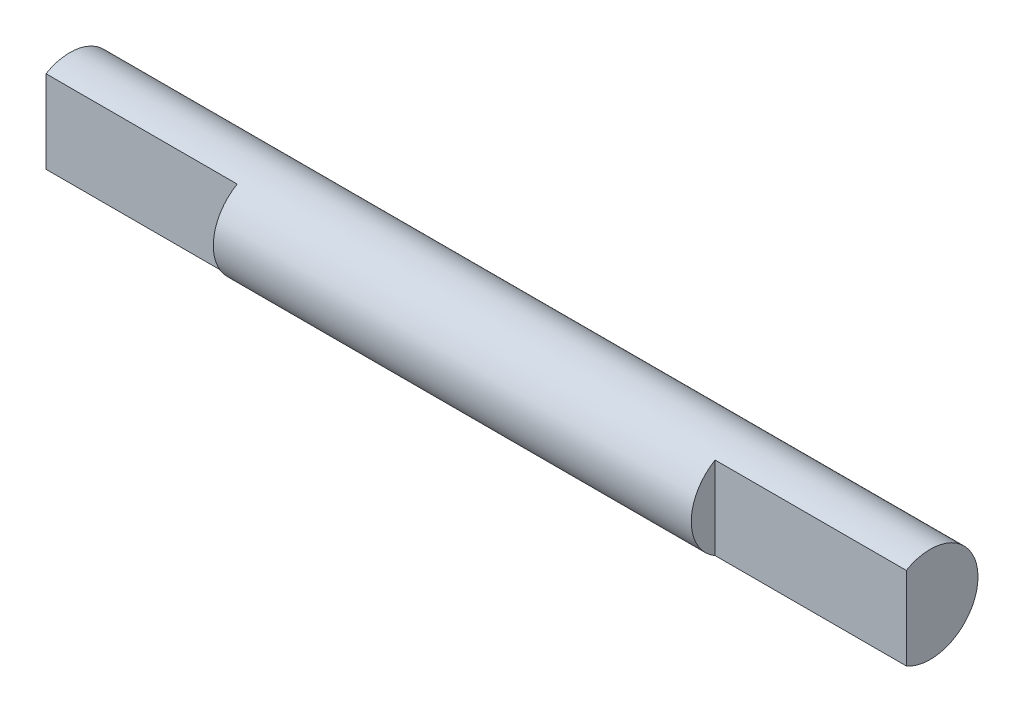
ISO-10303-21;
HEADER;
FILE_DESCRIPTION(('STEP AP214'),'2;1');
FILE_NAME('part.step','',(''),(''),'','','');
FILE_SCHEMA(('AUTOMOTIVE_DESIGN { 1 0 10303 214 1 1 1 1 }'));
ENDSEC;
DATA;
#1=APPLICATION_CONTEXT('core data for automotive mechanical design processes');
#2=APPLICATION_PROTOCOL_DEFINITION('international standard','automotive_design',2000,#1);
#3=PRODUCT_CONTEXT('',#1,'mechanical');
#4=PRODUCT('Part','Part','',(#3));
#5=PRODUCT_RELATED_PRODUCT_CATEGORY('part','',(#4));
#6=PRODUCT_DEFINITION_FORMATION('','',#4);
#7=PRODUCT_DEFINITION_CONTEXT('part definition',#1,'design');
#8=PRODUCT_DEFINITION('design','',#6,#7);
#9=PRODUCT_DEFINITION_SHAPE('','',#8);
#10=(LENGTH_UNIT() NAMED_UNIT(*) SI_UNIT(.MILLI.,.METRE.));
#11=(NAMED_UNIT(*) PLANE_ANGLE_UNIT() SI_UNIT($,.RADIAN.));
#12=(NAMED_UNIT(*) SI_UNIT($,.STERADIAN.) SOLID_ANGLE_UNIT());
#13=UNCERTAINTY_MEASURE_WITH_UNIT(LENGTH_MEASURE(1.E-05),#10,'distance_accuracy_value','');
#14=(GEOMETRIC_REPRESENTATION_CONTEXT(3) GLOBAL_UNCERTAINTY_ASSIGNED_CONTEXT((#13)) GLOBAL_UNIT_ASSIGNED_CONTEXT((#10,
#11,#12)) REPRESENTATION_CONTEXT('',''));
#15=CARTESIAN_POINT('',(0.,0.,0.));
#16=DIRECTION('',(0.,0.,1.));
#17=DIRECTION('',(1.,0.,0.));
#18=AXIS2_PLACEMENT_3D('',#15,#16,#17);
#19=CARTESIAN_POINT('',(63.5,0.,0.));
#20=DIRECTION('',(-1.,0.,0.));
#21=DIRECTION('',(0.,0.,1.));
#22=AXIS2_PLACEMENT_3D('',#19,#20,#21);
#23=CYLINDRICAL_SURFACE('',#22,12.7);
#24=CARTESIAN_POINT('',(63.5,0.,0.));
#25=DIRECTION('',(1.,0.,0.));
#26=DIRECTION('',(0.,0.,-1.));
#27=AXIS2_PLACEMENT_3D('',#24,#25,#26);
#28=CIRCLE('',#27,12.7);
#29=CARTESIAN_POINT('',(63.5,10.9985226280624,6.35));
#30=VERTEX_POINT('',#29);
#31=CARTESIAN_POINT('',(63.5,-10.9985226280624,6.35));
#32=VERTEX_POINT('',#31);
#33=EDGE_CURVE('E11',#30,#32,#28,.T.);
#34=ORIENTED_EDGE('',*,*,#33,.F.);
#35=DIRECTION('',(-1.,0.,0.));
#36=VECTOR('',#35,1.);
#37=CARTESIAN_POINT('',(114.3,10.9985226280624,6.35));
#38=LINE('',#37,#36);
#39=CARTESIAN_POINT('',(114.3,10.9985226280624,6.35));
#40=VERTEX_POINT('',#39);
#41=EDGE_CURVE('E100',#40,#30,#38,.T.);
#42=ORIENTED_EDGE('',*,*,#41,.F.);
#43=CARTESIAN_POINT('',(114.3,0.,0.));
#44=DIRECTION('',(1.,0.,0.));
#45=DIRECTION('',(0.,0.,-1.));
#46=AXIS2_PLACEMENT_3D('',#43,#44,#45);
#47=CIRCLE('',#46,12.7);
#48=CARTESIAN_POINT('',(114.3,-10.9985226280624,6.35));
#49=VERTEX_POINT('',#48);
#50=EDGE_CURVE('E91',#49,#40,#47,.T.);
#51=ORIENTED_EDGE('',*,*,#50,.F.);
#52=DIRECTION('',(-1.,0.,0.));
#53=VECTOR('',#52,1.);
#54=CARTESIAN_POINT('',(114.3,-10.9985226280624,6.35));
#55=LINE('',#54,#53);
#56=EDGE_CURVE('E96',#49,#32,#55,.T.);
#57=ORIENTED_EDGE('',*,*,#56,.T.);
#58=EDGE_LOOP('',(#34,#42,#51,#57));
#59=FACE_BOUND('',#58,.T.);
#60=CARTESIAN_POINT('',(-63.5,0.,0.));
#61=DIRECTION('',(1.,0.,0.));
#62=DIRECTION('',(0.,0.,-1.));
#63=AXIS2_PLACEMENT_3D('',#60,#61,#62);
#64=CIRCLE('',#63,12.7);
#65=CARTESIAN_POINT('',(-63.5,10.9985226280624,6.35));
#66=VERTEX_POINT('',#65);
#67=CARTESIAN_POINT('',(-63.5,-10.9985226280624,6.35));
#68=VERTEX_POINT('',#67);
#69=EDGE_CURVE('E38',#66,#68,#64,.T.);
#70=ORIENTED_EDGE('',*,*,#69,.T.);
#71=DIRECTION('',(1.,0.,0.));
#72=VECTOR('',#71,1.);
#73=CARTESIAN_POINT('',(-114.3,-10.9985226280624,6.35));
#74=LINE('',#73,#72);
#75=CARTESIAN_POINT('',(-114.3,-10.9985226280624,6.35));
#76=VERTEX_POINT('',#75);
#77=EDGE_CURVE('E49',#76,#68,#74,.T.);
#78=ORIENTED_EDGE('',*,*,#77,.F.);
#79=CARTESIAN_POINT('',(-114.3,0.,0.));
#80=DIRECTION('',(1.,0.,0.));
#81=DIRECTION('',(0.,0.,-1.));
#82=AXIS2_PLACEMENT_3D('',#79,#80,#81);
#83=CIRCLE('',#82,12.7);
#84=CARTESIAN_POINT('',(-114.3,10.9985226280624,6.35));
#85=VERTEX_POINT('',#84);
#86=EDGE_CURVE('E76',#76,#85,#83,.T.);
#87=ORIENTED_EDGE('',*,*,#86,.T.);
#88=DIRECTION('',(1.,0.,0.));
#89=VECTOR('',#88,1.);
#90=CARTESIAN_POINT('',(-114.3,10.9985226280624,6.35));
#91=LINE('',#90,#89);
#92=EDGE_CURVE('E79',#85,#66,#91,.T.);
#93=ORIENTED_EDGE('',*,*,#92,.T.);
#94=EDGE_LOOP('',(#70,#78,#87,#93));
#95=FACE_BOUND('',#94,.T.);
#96=ADVANCED_FACE('F35',(#59,#95),#23,.T.);
#97=CARTESIAN_POINT('',(63.5,0.,0.));
#98=DIRECTION('',(1.,0.,0.));
#99=DIRECTION('',(0.,0.,-1.));
#100=AXIS2_PLACEMENT_3D('',#97,#98,#99);
#101=PLANE('',#100);
#102=DIRECTION('',(0.,-1.,0.));
#103=VECTOR('',#102,1.);
#104=CARTESIAN_POINT('',(63.5,0.,6.35));
#105=LINE('',#104,#103);
#106=EDGE_CURVE('E55',#30,#32,#105,.T.);
#107=ORIENTED_EDGE('',*,*,#106,.F.);
#108=ORIENTED_EDGE('',*,*,#33,.T.);
#109=EDGE_LOOP('',(#107,#108));
#110=FACE_BOUND('',#109,.T.);
#111=ADVANCED_FACE('F108',(#110),#101,.T.);
#112=CARTESIAN_POINT('',(-63.5,0.,0.));
#113=DIRECTION('',(1.,0.,0.));
#114=DIRECTION('',(0.,0.,-1.));
#115=AXIS2_PLACEMENT_3D('',#112,#113,#114);
#116=PLANE('',#115);
#117=ORIENTED_EDGE('',*,*,#69,.F.);
#118=DIRECTION('',(0.,-1.,0.));
#119=VECTOR('',#118,1.);
#120=CARTESIAN_POINT('',(-63.5,0.,6.35));
#121=LINE('',#120,#119);
#122=EDGE_CURVE('E84',#66,#68,#121,.T.);
#123=ORIENTED_EDGE('',*,*,#122,.T.);
#124=EDGE_LOOP('',(#117,#123));
#125=FACE_BOUND('',#124,.T.);
#126=ADVANCED_FACE('F110',(#125),#116,.F.);
#127=CARTESIAN_POINT('',(114.3,0.,6.35));
#128=DIRECTION('',(0.,0.,-1.));
#129=DIRECTION('',(-1.,0.,0.));
#130=AXIS2_PLACEMENT_3D('',#127,#128,#129);
#131=PLANE('',#130);
#132=ORIENTED_EDGE('',*,*,#106,.T.);
#133=ORIENTED_EDGE('',*,*,#56,.F.);
#134=DIRECTION('',(0.,-1.,0.));
#135=VECTOR('',#134,1.);
#136=CARTESIAN_POINT('',(114.3,0.,6.35));
#137=LINE('',#136,#135);
#138=EDGE_CURVE('E94',#40,#49,#137,.T.);
#139=ORIENTED_EDGE('',*,*,#138,.F.);
#140=ORIENTED_EDGE('',*,*,#41,.T.);
#141=EDGE_LOOP('',(#132,#133,#139,#140));
#142=FACE_BOUND('',#141,.T.);
#143=ADVANCED_FACE('F104',(#142),#131,.F.);
#144=CARTESIAN_POINT('',(114.3,0.,0.));
#145=DIRECTION('',(1.,0.,0.));
#146=DIRECTION('',(0.,0.,-1.));
#147=AXIS2_PLACEMENT_3D('',#144,#145,#146);
#148=PLANE('',#147);
#149=ORIENTED_EDGE('',*,*,#50,.T.);
#150=ORIENTED_EDGE('',*,*,#138,.T.);
#151=EDGE_LOOP('',(#149,#150));
#152=FACE_BOUND('',#151,.T.);
#153=ADVANCED_FACE('F120',(#152),#148,.T.);
#154=CARTESIAN_POINT('',(-114.3,0.,6.35));
#155=DIRECTION('',(0.,0.,1.));
#156=DIRECTION('',(1.,0.,0.));
#157=AXIS2_PLACEMENT_3D('',#154,#155,#156);
#158=PLANE('',#157);
#159=ORIENTED_EDGE('',*,*,#122,.F.);
#160=ORIENTED_EDGE('',*,*,#92,.F.);
#161=DIRECTION('',(0.,-1.,0.));
#162=VECTOR('',#161,1.);
#163=CARTESIAN_POINT('',(-114.3,0.,6.35));
#164=LINE('',#163,#162);
#165=EDGE_CURVE('E83',#85,#76,#164,.T.);
#166=ORIENTED_EDGE('',*,*,#165,.T.);
#167=ORIENTED_EDGE('',*,*,#77,.T.);
#168=EDGE_LOOP('',(#159,#160,#166,#167));
#169=FACE_BOUND('',#168,.T.);
#170=ADVANCED_FACE('F86',(#169),#158,.T.);
#171=CARTESIAN_POINT('',(-114.3,0.,0.));
#172=DIRECTION('',(-1.,0.,0.));
#173=DIRECTION('',(0.,0.,-1.));
#174=AXIS2_PLACEMENT_3D('',#171,#172,#173);
#175=PLANE('',#174);
#176=ORIENTED_EDGE('',*,*,#86,.F.);
#177=ORIENTED_EDGE('',*,*,#165,.F.);
#178=EDGE_LOOP('',(#176,#177));
#179=FACE_BOUND('',#178,.T.);
#180=ADVANCED_FACE('F82',(#179),#175,.T.);
#181=CLOSED_SHELL('',(#96,#111,#126,#143,#153,#170,#180));
#182=MANIFOLD_SOLID_BREP('B2',#181);
#183=ADVANCED_BREP_SHAPE_REPRESENTATION('',(#18,#182),#14);
#184=SHAPE_DEFINITION_REPRESENTATION(#9,#183);
ENDSEC;
END-ISO-10303-21;
